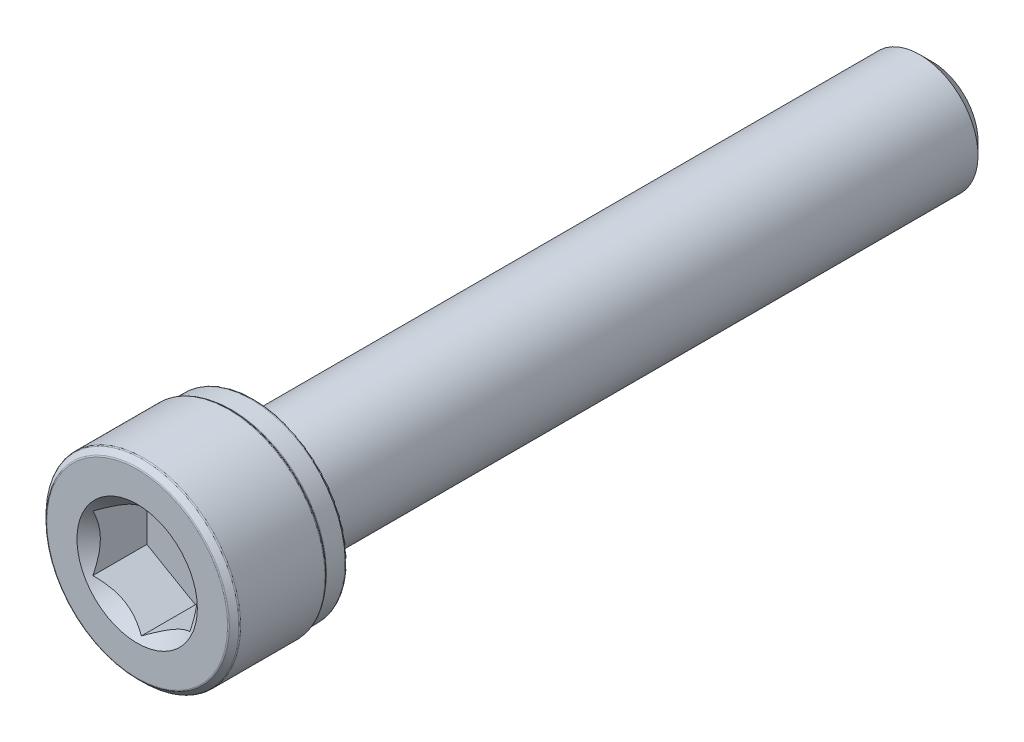
ISO-10303-21;
HEADER;
FILE_DESCRIPTION(('STEP AP214'),'2;1');
FILE_NAME('part.step','',(''),(''),'','','');
FILE_SCHEMA(('AUTOMOTIVE_DESIGN { 1 0 10303 214 1 1 1 1 }'));
ENDSEC;
DATA;
#1=APPLICATION_CONTEXT('core data for automotive mechanical design processes');
#2=APPLICATION_PROTOCOL_DEFINITION('international standard','automotive_design',2000,#1);
#3=PRODUCT_CONTEXT('',#1,'mechanical');
#4=PRODUCT('Part','Part','',(#3));
#5=PRODUCT_RELATED_PRODUCT_CATEGORY('part','',(#4));
#6=PRODUCT_DEFINITION_FORMATION('','',#4);
#7=PRODUCT_DEFINITION_CONTEXT('part definition',#1,'design');
#8=PRODUCT_DEFINITION('design','',#6,#7);
#9=PRODUCT_DEFINITION_SHAPE('','',#8);
#10=(LENGTH_UNIT() NAMED_UNIT(*) SI_UNIT(.MILLI.,.METRE.));
#11=(NAMED_UNIT(*) PLANE_ANGLE_UNIT() SI_UNIT($,.RADIAN.));
#12=(NAMED_UNIT(*) SI_UNIT($,.STERADIAN.) SOLID_ANGLE_UNIT());
#13=UNCERTAINTY_MEASURE_WITH_UNIT(LENGTH_MEASURE(1.E-05),#10,'distance_accuracy_value','');
#14=(GEOMETRIC_REPRESENTATION_CONTEXT(3) GLOBAL_UNCERTAINTY_ASSIGNED_CONTEXT((#13)) GLOBAL_UNIT_ASSIGNED_CONTEXT((#10,
#11,#12)) REPRESENTATION_CONTEXT('',''));
#15=CARTESIAN_POINT('',(0.,0.,0.));
#16=DIRECTION('',(0.,0.,1.));
#17=DIRECTION('',(1.,0.,0.));
#18=AXIS2_PLACEMENT_3D('',#15,#16,#17);
#19=CARTESIAN_POINT('',(0.,2.35048094716167,-20.5));
#20=DIRECTION('',(0.,0.,-1.));
#21=DIRECTION('',(0.,1.,0.));
#22=AXIS2_PLACEMENT_3D('',#19,#20,#21);
#23=PLANE('',#22);
#24=CARTESIAN_POINT('',(0.,0.,-20.5));
#25=DIRECTION('',(0.,0.,-1.));
#26=DIRECTION('',(0.,1.,0.));
#27=AXIS2_PLACEMENT_3D('',#24,#25,#26);
#28=CIRCLE('',#27,2.35048094716167);
#29=CARTESIAN_POINT('',(0.,2.35048094716167,-20.5));
#30=VERTEX_POINT('',#29);
#31=EDGE_CURVE('E12',#30,#30,#28,.T.);
#32=ORIENTED_EDGE('',*,*,#31,.T.);
#33=EDGE_LOOP('',(#32));
#34=FACE_BOUND('',#33,.T.);
#35=ADVANCED_FACE('F38',(#34),#23,.T.);
#36=CARTESIAN_POINT('',(0.,0.,-20.5));
#37=DIRECTION('',(0.,0.,1.));
#38=DIRECTION('',(0.,-1.,0.));
#39=AXIS2_PLACEMENT_3D('',#36,#37,#38);
#40=CONICAL_SURFACE('',#39,2.35048094716167,0.785398163397439);
#41=CARTESIAN_POINT('',(0.,0.,-19.8504809471617));
#42=DIRECTION('',(0.,0.,-1.));
#43=DIRECTION('',(0.,1.,0.));
#44=AXIS2_PLACEMENT_3D('',#41,#42,#43);
#45=CIRCLE('',#44,3.);
#46=CARTESIAN_POINT('',(0.,3.,-19.8504809471617));
#47=VERTEX_POINT('',#46);
#48=EDGE_CURVE('E45',#47,#47,#45,.T.);
#49=ORIENTED_EDGE('',*,*,#48,.T.);
#50=EDGE_LOOP('',(#49));
#51=FACE_BOUND('',#50,.T.);
#52=ORIENTED_EDGE('',*,*,#31,.F.);
#53=EDGE_LOOP('',(#52));
#54=FACE_BOUND('',#53,.T.);
#55=ADVANCED_FACE('F157',(#51,#54),#40,.T.);
#56=CARTESIAN_POINT('',(0.,0.,-20.5));
#57=DIRECTION('',(0.,0.,-1.));
#58=DIRECTION('',(0.,1.,0.));
#59=AXIS2_PLACEMENT_3D('',#56,#57,#58);
#60=CYLINDRICAL_SURFACE('',#59,3.);
#61=CARTESIAN_POINT('',(0.,0.,14.2));
#62=DIRECTION('',(0.,0.,-1.));
#63=DIRECTION('',(0.,1.,0.));
#64=AXIS2_PLACEMENT_3D('',#61,#62,#63);
#65=CIRCLE('',#64,3.);
#66=CARTESIAN_POINT('',(0.,3.,14.2));
#67=VERTEX_POINT('',#66);
#68=EDGE_CURVE('E152',#67,#67,#65,.T.);
#69=ORIENTED_EDGE('',*,*,#68,.T.);
#70=EDGE_LOOP('',(#69));
#71=FACE_BOUND('',#70,.T.);
#72=ORIENTED_EDGE('',*,*,#48,.F.);
#73=EDGE_LOOP('',(#72));
#74=FACE_BOUND('',#73,.T.);
#75=ADVANCED_FACE('F160',(#71,#74),#60,.T.);
#76=CARTESIAN_POINT('',(0.,0.,14.2));
#77=DIRECTION('',(0.,0.,-1.));
#78=DIRECTION('',(0.,1.,0.));
#79=AXIS2_PLACEMENT_3D('',#76,#77,#78);
#80=TOROIDAL_SURFACE('',#79,3.3,0.300000000000001);
#81=CARTESIAN_POINT('',(0.,0.,14.5));
#82=DIRECTION('',(0.,0.,-1.));
#83=DIRECTION('',(0.,1.,0.));
#84=AXIS2_PLACEMENT_3D('',#81,#82,#83);
#85=CIRCLE('',#84,3.3);
#86=CARTESIAN_POINT('',(0.,3.3,14.5));
#87=VERTEX_POINT('',#86);
#88=EDGE_CURVE('E149',#87,#87,#85,.T.);
#89=ORIENTED_EDGE('',*,*,#88,.T.);
#90=EDGE_LOOP('',(#89));
#91=FACE_BOUND('',#90,.T.);
#92=ORIENTED_EDGE('',*,*,#68,.F.);
#93=EDGE_LOOP('',(#92));
#94=FACE_BOUND('',#93,.T.);
#95=ADVANCED_FACE('F162',(#91,#94),#80,.F.);
#96=CARTESIAN_POINT('',(0.,4.725,14.5));
#97=DIRECTION('',(0.,0.,-1.));
#98=DIRECTION('',(0.,1.,0.));
#99=AXIS2_PLACEMENT_3D('',#96,#97,#98);
#100=PLANE('',#99);
#101=CARTESIAN_POINT('',(0.,0.,14.5));
#102=DIRECTION('',(0.,0.,-1.));
#103=DIRECTION('',(0.,1.,0.));
#104=AXIS2_PLACEMENT_3D('',#101,#102,#103);
#105=CIRCLE('',#104,4.725);
#106=CARTESIAN_POINT('',(0.,4.725,14.5));
#107=VERTEX_POINT('',#106);
#108=EDGE_CURVE('E146',#107,#107,#105,.T.);
#109=ORIENTED_EDGE('',*,*,#108,.T.);
#110=EDGE_LOOP('',(#109));
#111=FACE_BOUND('',#110,.T.);
#112=ORIENTED_EDGE('',*,*,#88,.F.);
#113=EDGE_LOOP('',(#112));
#114=FACE_BOUND('',#113,.T.);
#115=ADVANCED_FACE('F169',(#111,#114),#100,.T.);
#116=CARTESIAN_POINT('',(0.,0.,14.625));
#117=DIRECTION('',(0.,0.,-1.));
#118=DIRECTION('',(0.,1.,0.));
#119=AXIS2_PLACEMENT_3D('',#116,#117,#118);
#120=TOROIDAL_SURFACE('',#119,4.725,0.125);
#121=CARTESIAN_POINT('',(0.,0.,14.625));
#122=DIRECTION('',(0.,0.,-1.));
#123=DIRECTION('',(0.,1.,0.));
#124=AXIS2_PLACEMENT_3D('',#121,#122,#123);
#125=CIRCLE('',#124,4.85);
#126=CARTESIAN_POINT('',(0.,4.85,14.625));
#127=VERTEX_POINT('',#126);
#128=EDGE_CURVE('E143',#127,#127,#125,.T.);
#129=ORIENTED_EDGE('',*,*,#128,.T.);
#130=EDGE_LOOP('',(#129));
#131=FACE_BOUND('',#130,.T.);
#132=ORIENTED_EDGE('',*,*,#108,.F.);
#133=EDGE_LOOP('',(#132));
#134=FACE_BOUND('',#133,.T.);
#135=ADVANCED_FACE('F200',(#131,#134),#120,.T.);
#136=CARTESIAN_POINT('',(0.,0.,-20.5));
#137=DIRECTION('',(0.,0.,-1.));
#138=DIRECTION('',(0.,1.,0.));
#139=AXIS2_PLACEMENT_3D('',#136,#137,#138);
#140=CYLINDRICAL_SURFACE('',#139,4.85);
#141=CARTESIAN_POINT('',(0.,0.,15.5861674785275));
#142=DIRECTION('',(0.,0.,-1.));
#143=DIRECTION('',(0.,1.,0.));
#144=AXIS2_PLACEMENT_3D('',#141,#142,#143);
#145=CIRCLE('',#144,4.85);
#146=CARTESIAN_POINT('',(0.,4.85,15.5861674785275));
#147=VERTEX_POINT('',#146);
#148=EDGE_CURVE('E140',#147,#147,#145,.T.);
#149=ORIENTED_EDGE('',*,*,#148,.T.);
#150=EDGE_LOOP('',(#149));
#151=FACE_BOUND('',#150,.T.);
#152=ORIENTED_EDGE('',*,*,#128,.F.);
#153=EDGE_LOOP('',(#152));
#154=FACE_BOUND('',#153,.T.);
#155=ADVANCED_FACE('F210',(#151,#154),#140,.T.);
#156=CARTESIAN_POINT('',(0.,0.,15.5861674785275));
#157=DIRECTION('',(0.,0.,-1.));
#158=DIRECTION('',(0.,1.,0.));
#159=AXIS2_PLACEMENT_3D('',#156,#157,#158);
#160=TOROIDAL_SURFACE('',#159,4.94375,0.0937499999999986);
#161=CARTESIAN_POINT('',(0.,0.,15.6524587392638));
#162=DIRECTION('',(0.,0.,-1.));
#163=DIRECTION('',(0.,1.,0.));
#164=AXIS2_PLACEMENT_3D('',#161,#162,#163);
#165=CIRCLE('',#164,4.87745873926377);
#166=CARTESIAN_POINT('',(0.,4.87745873926377,15.6524587392638));
#167=VERTEX_POINT('',#166);
#168=EDGE_CURVE('E137',#167,#167,#165,.T.);
#169=ORIENTED_EDGE('',*,*,#168,.T.);
#170=EDGE_LOOP('',(#169));
#171=FACE_BOUND('',#170,.T.);
#172=ORIENTED_EDGE('',*,*,#148,.F.);
#173=EDGE_LOOP('',(#172));
#174=FACE_BOUND('',#173,.T.);
#175=ADVANCED_FACE('F220',(#171,#174),#160,.F.);
#176=CARTESIAN_POINT('',(0.,0.,15.6524587392638));
#177=DIRECTION('',(0.,0.,1.));
#178=DIRECTION('',(0.,-1.,0.));
#179=AXIS2_PLACEMENT_3D('',#176,#177,#178);
#180=CONICAL_SURFACE('',#179,4.87745873926377,0.785398163397448);
#181=CARTESIAN_POINT('',(0.,0.,15.7475412607362));
#182=DIRECTION('',(0.,0.,-1.));
#183=DIRECTION('',(0.,1.,0.));
#184=AXIS2_PLACEMENT_3D('',#181,#182,#183);
#185=CIRCLE('',#184,4.97254126073624);
#186=CARTESIAN_POINT('',(0.,4.97254126073624,15.7475412607362));
#187=VERTEX_POINT('',#186);
#188=EDGE_CURVE('E134',#187,#187,#185,.T.);
#189=ORIENTED_EDGE('',*,*,#188,.T.);
#190=EDGE_LOOP('',(#189));
#191=FACE_BOUND('',#190,.T.);
#192=ORIENTED_EDGE('',*,*,#168,.F.);
#193=EDGE_LOOP('',(#192));
#194=FACE_BOUND('',#193,.T.);
#195=ADVANCED_FACE('F230',(#191,#194),#180,.T.);
#196=CARTESIAN_POINT('',(0.,0.,15.8138325214725));
#197=DIRECTION('',(0.,0.,-1.));
#198=DIRECTION('',(0.,1.,0.));
#199=AXIS2_PLACEMENT_3D('',#196,#197,#198);
#200=TOROIDAL_SURFACE('',#199,4.90625,0.0937500000000017);
#201=CARTESIAN_POINT('',(0.,0.,15.8138325214725));
#202=DIRECTION('',(0.,0.,-1.));
#203=DIRECTION('',(0.,1.,0.));
#204=AXIS2_PLACEMENT_3D('',#201,#202,#203);
#205=CIRCLE('',#204,5.);
#206=CARTESIAN_POINT('',(0.,5.,15.8138325214725));
#207=VERTEX_POINT('',#206);
#208=EDGE_CURVE('E131',#207,#207,#205,.T.);
#209=ORIENTED_EDGE('',*,*,#208,.T.);
#210=EDGE_LOOP('',(#209));
#211=FACE_BOUND('',#210,.T.);
#212=ORIENTED_EDGE('',*,*,#188,.F.);
#213=EDGE_LOOP('',(#212));
#214=FACE_BOUND('',#213,.T.);
#215=ADVANCED_FACE('F240',(#211,#214),#200,.T.);
#216=CARTESIAN_POINT('',(0.,0.,-20.5));
#217=DIRECTION('',(0.,0.,-1.));
#218=DIRECTION('',(0.,1.,0.));
#219=AXIS2_PLACEMENT_3D('',#216,#217,#218);
#220=CYLINDRICAL_SURFACE('',#219,5.);
#221=CARTESIAN_POINT('',(0.,0.,20.1611674785275));
#222=DIRECTION('',(0.,0.,-1.));
#223=DIRECTION('',(0.,1.,0.));
#224=AXIS2_PLACEMENT_3D('',#221,#222,#223);
#225=CIRCLE('',#224,5.);
#226=CARTESIAN_POINT('',(0.,5.,20.1611674785275));
#227=VERTEX_POINT('',#226);
#228=EDGE_CURVE('E128',#227,#227,#225,.T.);
#229=ORIENTED_EDGE('',*,*,#228,.T.);
#230=EDGE_LOOP('',(#229));
#231=FACE_BOUND('',#230,.T.);
#232=ORIENTED_EDGE('',*,*,#208,.F.);
#233=EDGE_LOOP('',(#232));
#234=FACE_BOUND('',#233,.T.);
#235=ADVANCED_FACE('F250',(#231,#234),#220,.T.);
#236=CARTESIAN_POINT('',(0.,0.,20.1611674785275));
#237=DIRECTION('',(0.,0.,-1.));
#238=DIRECTION('',(0.,1.,0.));
#239=AXIS2_PLACEMENT_3D('',#236,#237,#238);
#240=TOROIDAL_SURFACE('',#239,4.90625,0.093749999999998);
#241=CARTESIAN_POINT('',(0.,0.,20.2274587392638));
#242=DIRECTION('',(0.,0.,-1.));
#243=DIRECTION('',(0.,1.,0.));
#244=AXIS2_PLACEMENT_3D('',#241,#242,#243);
#245=CIRCLE('',#244,4.97254126073624);
#246=CARTESIAN_POINT('',(0.,4.97254126073624,20.2274587392638));
#247=VERTEX_POINT('',#246);
#248=EDGE_CURVE('E125',#247,#247,#245,.T.);
#249=ORIENTED_EDGE('',*,*,#248,.T.);
#250=EDGE_LOOP('',(#249));
#251=FACE_BOUND('',#250,.T.);
#252=ORIENTED_EDGE('',*,*,#228,.F.);
#253=EDGE_LOOP('',(#252));
#254=FACE_BOUND('',#253,.T.);
#255=ADVANCED_FACE('F260',(#251,#254),#240,.T.);
#256=CARTESIAN_POINT('',(0.,0.,20.2274587392638));
#257=DIRECTION('',(0.,0.,-1.));
#258=DIRECTION('',(0.,1.,0.));
#259=AXIS2_PLACEMENT_3D('',#256,#257,#258);
#260=CONICAL_SURFACE('',#259,4.97254126073624,0.785398163397445);
#261=CARTESIAN_POINT('',(0.,0.,20.4725412607362));
#262=DIRECTION('',(0.,0.,-1.));
#263=DIRECTION('',(0.,1.,0.));
#264=AXIS2_PLACEMENT_3D('',#261,#262,#263);
#265=CIRCLE('',#264,4.72745873926376);
#266=CARTESIAN_POINT('',(0.,4.72745873926376,20.4725412607362));
#267=VERTEX_POINT('',#266);
#268=EDGE_CURVE('E122',#267,#267,#265,.T.);
#269=ORIENTED_EDGE('',*,*,#268,.T.);
#270=EDGE_LOOP('',(#269));
#271=FACE_BOUND('',#270,.T.);
#272=ORIENTED_EDGE('',*,*,#248,.F.);
#273=EDGE_LOOP('',(#272));
#274=FACE_BOUND('',#273,.T.);
#275=ADVANCED_FACE('F270',(#271,#274),#260,.T.);
#276=CARTESIAN_POINT('',(0.,0.,20.40625));
#277=DIRECTION('',(0.,0.,-1.));
#278=DIRECTION('',(0.,1.,0.));
#279=AXIS2_PLACEMENT_3D('',#276,#277,#278);
#280=TOROIDAL_SURFACE('',#279,4.66116747852752,0.0937500000000004);
#281=CARTESIAN_POINT('',(0.,0.,20.5));
#282=DIRECTION('',(0.,0.,-1.));
#283=DIRECTION('',(0.,1.,0.));
#284=AXIS2_PLACEMENT_3D('',#281,#282,#283);
#285=CIRCLE('',#284,4.66116747852752);
#286=CARTESIAN_POINT('',(0.,4.66116747852752,20.5));
#287=VERTEX_POINT('',#286);
#288=EDGE_CURVE('E119',#287,#287,#285,.T.);
#289=ORIENTED_EDGE('',*,*,#288,.T.);
#290=EDGE_LOOP('',(#289));
#291=FACE_BOUND('',#290,.T.);
#292=ORIENTED_EDGE('',*,*,#268,.F.);
#293=EDGE_LOOP('',(#292));
#294=FACE_BOUND('',#293,.T.);
#295=ADVANCED_FACE('F280',(#291,#294),#280,.T.);
#296=CARTESIAN_POINT('',(0.,0.,20.5));
#297=DIRECTION('',(0.,0.,1.));
#298=DIRECTION('',(0.,-1.,0.));
#299=AXIS2_PLACEMENT_3D('',#296,#297,#298);
#300=PLANE('',#299);
#301=CARTESIAN_POINT('',(0.,0.,20.5));
#302=DIRECTION('',(0.,0.,1.));
#303=DIRECTION('',(1.,0.,0.));
#304=AXIS2_PLACEMENT_3D('',#301,#302,#303);
#305=CIRCLE('',#304,3.10325769689423);
#306=CARTESIAN_POINT('',(3.10325769689423,0.,20.5));
#307=VERTEX_POINT('',#306);
#308=EDGE_CURVE('E96',#307,#307,#305,.T.);
#309=ORIENTED_EDGE('',*,*,#308,.F.);
#310=EDGE_LOOP('',(#309));
#311=FACE_BOUND('',#310,.T.);
#312=ORIENTED_EDGE('',*,*,#288,.F.);
#313=EDGE_LOOP('',(#312));
#314=FACE_BOUND('',#313,.T.);
#315=ADVANCED_FACE('F290',(#311,#314),#300,.T.);
#316=CARTESIAN_POINT('',(0.,0.,20.5));
#317=DIRECTION('',(0.,0.,1.));
#318=DIRECTION('',(1.,0.,0.));
#319=AXIS2_PLACEMENT_3D('',#316,#317,#318);
#320=CONICAL_SURFACE('',#319,3.10325769689423,0.78539816339745);
#321=ORIENTED_EDGE('',*,*,#308,.T.);
#322=EDGE_LOOP('',(#321));
#323=FACE_BOUND('',#322,.T.);
#324=CARTESIAN_POINT('',(-2.50019999999999,-1.44326020292022,20.2836091260357));
#325=CARTESIAN_POINT('',(-2.41426172221223,-1.49287669073468,20.2340343544086));
#326=CARTESIAN_POINT('',(-2.32688643272424,-1.54332283764109,20.1873711304164));
#327=CARTESIAN_POINT('',(-2.14871854383441,-1.64618811625259,20.1019317890922));
#328=CARTESIAN_POINT('',(-2.05790899931892,-1.69861703122359,20.0632032114599));
#329=CARTESIAN_POINT('',(-1.87479587687308,-1.80433744175985,19.9968603529516));
#330=CARTESIAN_POINT('',(-1.78253893547066,-1.85760201171315,19.9690793175848));
#331=CARTESIAN_POINT('',(-1.59599399122371,-1.96530378549009,19.9262768249646));
#332=CARTESIAN_POINT('',(-1.50171168743371,-2.01973769896306,19.9112234157252));
#333=CARTESIAN_POINT('',(-1.33922174170815,-2.11355131286832,19.8976413712634));
#334=CARTESIAN_POINT('',(-1.27122403211985,-2.15280980880341,19.8956307482947));
#335=CARTESIAN_POINT('',(-1.13533975883078,-2.23126263056549,19.8990177662414));
#336=CARTESIAN_POINT('',(-1.06745324244776,-2.27045692907357,19.9044180043537));
#337=CARTESIAN_POINT('',(-0.932321211763892,-2.34847544336504,19.9223194374564));
#338=CARTESIAN_POINT('',(-0.865076500246437,-2.38729919566122,19.9348285761004));
#339=CARTESIAN_POINT('',(-0.731749899181799,-2.46427534467603,19.9662611510096));
#340=CARTESIAN_POINT('',(-0.665667920900341,-2.50242779262541,19.9851840955507));
#341=CARTESIAN_POINT('',(-0.496403653308734,-2.60015256308361,20.0413610104621));
#342=CARTESIAN_POINT('',(-0.394270877777105,-2.65911894852988,20.0828494806501));
#343=CARTESIAN_POINT('',(-0.244093585059489,-2.74582384890656,20.152887695777));
#344=CARTESIAN_POINT('',(-0.194603460117388,-2.77439698586411,20.17749590117));
#345=CARTESIAN_POINT('',(-0.09653993616115,-2.83101398781793,20.2289555357691));
#346=CARTESIAN_POINT('',(-0.0479659965030684,-2.85905816495513,20.2558055878332));
#347=CARTESIAN_POINT('',(0.000200000000003583,-2.88686681600196,20.2836091260357));
#348=B_SPLINE_CURVE_WITH_KNOTS('',3,(#324,#325,#326,#327,#328,#329,#330,#331,#332,#333,#334,
#335,#336,#337,#338,#339,#340,#341,#342,#343,#344,#345,#346,#347),.UNSPECIFIED.,.F.,.F.,(4,2,2,
2,2,2,2,2,2,2,2,4),(0.,0.333012085133923,0.667964518301395,0.997597032043295,1.32639954393844,
1.56169424147168,1.79707142102082,2.0327121352217,2.2683347877565,2.64260240809533,
2.82922877818863,3.01574133749024),.UNSPECIFIED.);
#349=CARTESIAN_POINT('',(-2.49999999999999,-1.44337567297406,20.2834936490539));
#350=VERTEX_POINT('',#349);
#351=CARTESIAN_POINT('',(0.,-2.88675134594812,20.2834936490539));
#352=VERTEX_POINT('',#351);
#353=EDGE_CURVE('E103',#350,#352,#348,.T.);
#354=ORIENTED_EDGE('',*,*,#353,.F.);
#355=CARTESIAN_POINT('',(-2.49999999999999,-3.04044292478689,21.3330214063817));
#356=CARTESIAN_POINT('',(-2.49999999999999,-2.96709478172556,21.2763788487171));
#357=CARTESIAN_POINT('',(-2.49999999999999,-2.89335465135761,21.2202359693275));
#358=CARTESIAN_POINT('',(-2.49999999999999,-2.74492905640711,21.1091787819783));
#359=CARTESIAN_POINT('',(-2.49999999999999,-2.67024337493574,21.0542647641906));
#360=CARTESIAN_POINT('',(-2.49999999999999,-2.51921990828823,20.9455038420407));
#361=CARTESIAN_POINT('',(-2.49999999999999,-2.44287382770905,20.891668419147));
#362=CARTESIAN_POINT('',(-2.49999999999999,-2.28891665120371,20.7858441602624));
#363=CARTESIAN_POINT('',(-2.49999999999999,-2.21130564250584,20.7338551977208));
#364=CARTESIAN_POINT('',(-2.49999999999999,-2.04951799142744,20.6288457042913));
#365=CARTESIAN_POINT('',(-2.49999999999999,-1.96524215656548,20.5759772332794));
#366=CARTESIAN_POINT('',(-2.49999999999999,-1.79473490703968,20.4734987026906));
#367=CARTESIAN_POINT('',(-2.49999999999999,-1.70850374831487,20.4238882199388));
#368=CARTESIAN_POINT('',(-2.49999999999999,-1.53401833929874,20.3289545270337));
#369=CARTESIAN_POINT('',(-2.49999999999999,-1.44577065756376,20.2836193384592));
#370=CARTESIAN_POINT('',(-2.49999999999999,-1.26676310994808,20.1982604224777));
#371=CARTESIAN_POINT('',(-2.49999999999999,-1.17600446376454,20.158234169168));
#372=CARTESIAN_POINT('',(-2.49999999999999,-1.00118351570531,20.0886962875671));
#373=CARTESIAN_POINT('',(-2.49999999999999,-0.917385051629535,20.0585280842829));
#374=CARTESIAN_POINT('',(-2.49999999999999,-0.74762906009993,20.0048969377877));
#375=CARTESIAN_POINT('',(-2.49999999999999,-0.661671397551603,19.9814344152734));
#376=CARTESIAN_POINT('',(-2.49999999999999,-0.489622081200866,19.9428857605003));
#377=CARTESIAN_POINT('',(-2.49999999999999,-0.403565521298247,19.9276456482725));
#378=CARTESIAN_POINT('',(-2.49999999999999,-0.230352389629815,19.9058639492467));
#379=CARTESIAN_POINT('',(-2.49999999999999,-0.143196059113858,19.8993204870893));
#380=CARTESIAN_POINT('',(-2.49999999999999,0.0273612295446655,19.895504167584));
#381=CARTESIAN_POINT('',(-2.49999999999999,0.1107531319748,19.8978241071313));
#382=CARTESIAN_POINT('',(-2.49999999999999,0.276898134935756,19.9106653349727));
#383=CARTESIAN_POINT('',(-2.49999999999999,0.359651177707744,19.921187356241));
#384=CARTESIAN_POINT('',(-2.49999999999999,0.525325927795181,19.9500114990314));
#385=CARTESIAN_POINT('',(-2.49999999999999,0.608223175291063,19.9684520406654));
#386=CARTESIAN_POINT('',(-2.49999999999999,0.772178834557463,20.0120846864152));
#387=CARTESIAN_POINT('',(-2.5,0.853237339741923,20.0372764467107));
#388=CARTESIAN_POINT('',(-2.5,1.10159689599554,20.1241193926927));
#389=CARTESIAN_POINT('',(-2.5,1.2655525401235,20.1953668377805));
#390=CARTESIAN_POINT('',(-2.5,1.50551769780195,20.3142345481021));
#391=CARTESIAN_POINT('',(-2.5,1.58465788064154,20.3559484521643));
#392=CARTESIAN_POINT('',(-2.5,1.74114816885993,20.4426161601922));
#393=CARTESIAN_POINT('',(-2.5,1.81849858456147,20.4875693968529));
#394=CARTESIAN_POINT('',(-2.5,1.96784059769267,20.5777853522682));
#395=CARTESIAN_POINT('',(-2.5,2.03990833441822,20.6229234485208));
#396=CARTESIAN_POINT('',(-2.5,2.18280709640722,20.7151257428437));
#397=CARTESIAN_POINT('',(-2.5,2.2536380285734,20.7621900850232));
#398=CARTESIAN_POINT('',(-2.5,2.39365462675841,20.8575181428367));
#399=CARTESIAN_POINT('',(-2.5,2.46284892785042,20.905769227967));
#400=CARTESIAN_POINT('',(-2.5,2.60028772768959,21.0035675953205));
#401=CARTESIAN_POINT('',(-2.5,2.66853248306037,21.0531145164816));
#402=CARTESIAN_POINT('',(-2.5,2.73637900498552,21.1031920948776));
#403=B_SPLINE_CURVE_WITH_KNOTS('',3,(#355,#356,#357,#358,#359,#360,#361,#362,#363,#364,#365,
#366,#367,#368,#369,#370,#371,#372,#373,#374,#375,#376,#377,#378,#379,#380,#381,#382,#383,#384,
#385,#386,#387,#388,#389,#390,#391,#392,#393,#394,#395,#396,#397,#398,#399,#400,#401,#402),
.UNSPECIFIED.,.F.,.F.,(4,2,2,2,2,2,2,2,2,2,2,2,2,2,2,2,2,2,2,2,2,2,2,4),(0.,0.278024739230087,
0.556114450273835,0.83634673753147,1.11655978131475,1.41496015304213,1.71332168905072,
2.01082076966665,2.30817779353376,2.57513879386763,2.84211653895114,3.10390388797606,
3.36563477559627,3.61548897009283,3.8653654952273,4.11980016461985,4.37422187884308,
4.90887010890444,5.17722912654035,5.44554126009377,5.70061957252691,5.95571700326382,
6.20877059828286,6.46175442014511),.UNSPECIFIED.);
#404=CARTESIAN_POINT('',(-2.5,1.44337567297406,20.2834936490539));
#405=VERTEX_POINT('',#404);
#406=EDGE_CURVE('E414',#405,#350,#403,.F.);
#407=ORIENTED_EDGE('',*,*,#406,.F.);
#408=CARTESIAN_POINT('',(0.000200000000000959,2.88686681600196,20.2836091260357));
#409=CARTESIAN_POINT('',(-0.0857382777877635,2.8372503281875,20.2340343544086));
#410=CARTESIAN_POINT('',(-0.173113567275752,2.78680418128109,20.1873711304164));
#411=CARTESIAN_POINT('',(-0.351281456165587,2.6839389026696,20.1019317890922));
#412=CARTESIAN_POINT('',(-0.442091000681073,2.63150998769859,20.0632032114599));
#413=CARTESIAN_POINT('',(-0.625204123126919,2.52578957716233,19.9968603529516));
#414=CARTESIAN_POINT('',(-0.717461064529339,2.47252500720903,19.9690793175848));
#415=CARTESIAN_POINT('',(-0.904006008776284,2.3648232334321,19.9262768249646));
#416=CARTESIAN_POINT('',(-0.998288312566281,2.31038931995912,19.9112234157252));
#417=CARTESIAN_POINT('',(-1.16077825829184,2.21657570605386,19.8976413712634));
#418=CARTESIAN_POINT('',(-1.22877596788015,2.17731721011878,19.8956307482947));
#419=CARTESIAN_POINT('',(-1.36466024116922,2.0988643883567,19.8990177662414));
#420=CARTESIAN_POINT('',(-1.43254675755223,2.05967008984862,19.9044180043537));
#421=CARTESIAN_POINT('',(-1.5676787882361,1.98165157555714,19.9223194374564));
#422=CARTESIAN_POINT('',(-1.63492349975356,1.94282782326096,19.9348285761004));
#423=CARTESIAN_POINT('',(-1.76825010081819,1.86585167424616,19.9662611510096));
#424=CARTESIAN_POINT('',(-1.83433207909965,1.82769922629677,19.9851840955507));
#425=CARTESIAN_POINT('',(-2.00359634669126,1.72997445583857,20.0413610104621));
#426=CARTESIAN_POINT('',(-2.10572912222289,1.6710080703923,20.0828494806501));
#427=CARTESIAN_POINT('',(-2.2559064149405,1.58430317001562,20.152887695777));
#428=CARTESIAN_POINT('',(-2.3053965398826,1.55573003305807,20.17749590117));
#429=CARTESIAN_POINT('',(-2.40346006383884,1.49911303110425,20.2289555357691));
#430=CARTESIAN_POINT('',(-2.45203400349692,1.47106885396706,20.2558055878333));
#431=CARTESIAN_POINT('',(-2.5002,1.44326020292022,20.2836091260357));
#432=B_SPLINE_CURVE_WITH_KNOTS('',3,(#408,#409,#410,#411,#412,#413,#414,#415,#416,#417,#418,
#419,#420,#421,#422,#423,#424,#425,#426,#427,#428,#429,#430,#431),.UNSPECIFIED.,.F.,.F.,(4,2,2,
2,2,2,2,2,2,2,2,4),(0.,0.333012085133924,0.667964518301397,0.9975970320433,1.32639954393844,
1.56169424147168,1.79707142102083,2.0327121352217,2.2683347877565,2.64260240809533,
2.82922877818863,3.01574133749024),.UNSPECIFIED.);
#433=CARTESIAN_POINT('',(0.,2.88675134594812,20.2834936490539));
#434=VERTEX_POINT('',#433);
#435=EDGE_CURVE('E409',#434,#405,#432,.T.);
#436=ORIENTED_EDGE('',*,*,#435,.F.);
#437=CARTESIAN_POINT('',(2.5002,1.44326020292022,20.2836091260357));
#438=CARTESIAN_POINT('',(2.41426172221223,1.49287669073468,20.2340343544086));
#439=CARTESIAN_POINT('',(2.32688643272425,1.54332283764109,20.1873711304164));
#440=CARTESIAN_POINT('',(2.14871854383441,1.64618811625259,20.1019317890922));
#441=CARTESIAN_POINT('',(2.05790899931892,1.69861703122359,20.0632032114599));
#442=CARTESIAN_POINT('',(1.87479587687308,1.80433744175985,19.9968603529516));
#443=CARTESIAN_POINT('',(1.78253893547066,1.85760201171315,19.9690793175848));
#444=CARTESIAN_POINT('',(1.59599399122371,1.96530378549009,19.9262768249646));
#445=CARTESIAN_POINT('',(1.50171168743372,2.01973769896306,19.9112234157252));
#446=CARTESIAN_POINT('',(1.33922174170815,2.11355131286832,19.8976413712634));
#447=CARTESIAN_POINT('',(1.27122403211985,2.15280980880341,19.8956307482947));
#448=CARTESIAN_POINT('',(1.13533975883078,2.23126263056549,19.8990177662414));
#449=CARTESIAN_POINT('',(1.06745324244776,2.27045692907357,19.9044180043537));
#450=CARTESIAN_POINT('',(0.932321211763893,2.34847544336504,19.9223194374564));
#451=CARTESIAN_POINT('',(0.865076500246439,2.38729919566122,19.9348285761004));
#452=CARTESIAN_POINT('',(0.731749899181801,2.46427534467603,19.9662611510096));
#453=CARTESIAN_POINT('',(0.665667920900342,2.50242779262541,19.9851840955507));
#454=CARTESIAN_POINT('',(0.496403653308735,2.60015256308361,20.0413610104621));
#455=CARTESIAN_POINT('',(0.394270877777107,2.65911894852988,20.0828494806501));
#456=CARTESIAN_POINT('',(0.244093585059491,2.74582384890657,20.152887695777));
#457=CARTESIAN_POINT('',(0.194603460117391,2.77439698586412,20.17749590117));
#458=CARTESIAN_POINT('',(0.0965399361611536,2.83101398781793,20.2289555357691));
#459=CARTESIAN_POINT('',(0.0479659965030723,2.85905816495513,20.2558055878333));
#460=CARTESIAN_POINT('',(-0.000199999999999767,2.88686681600196,20.2836091260357));
#461=B_SPLINE_CURVE_WITH_KNOTS('',3,(#437,#438,#439,#440,#441,#442,#443,#444,#445,#446,#447,
#448,#449,#450,#451,#452,#453,#454,#455,#456,#457,#458,#459,#460),.UNSPECIFIED.,.F.,.F.,(4,2,2,
2,2,2,2,2,2,2,2,4),(0.,0.333012085133923,0.667964518301396,0.997597032043298,1.32639954393844,
1.56169424147169,1.79707142102083,2.03271213522171,2.26833478775651,2.64260240809533,
2.82922877818864,3.01574133749025),.UNSPECIFIED.);
#462=CARTESIAN_POINT('',(2.5,1.44337567297406,20.2834936490539));
#463=VERTEX_POINT('',#462);
#464=EDGE_CURVE('E52',#463,#434,#461,.T.);
#465=ORIENTED_EDGE('',*,*,#464,.F.);
#466=CARTESIAN_POINT('',(2.5,-3.04044292478688,21.3330214063817));
#467=CARTESIAN_POINT('',(2.5,-2.96709478172555,21.2763788487171));
#468=CARTESIAN_POINT('',(2.5,-2.89335465135761,21.2202359693275));
#469=CARTESIAN_POINT('',(2.5,-2.74492905640711,21.1091787819783));
#470=CARTESIAN_POINT('',(2.5,-2.67024337493573,21.0542647641906));
#471=CARTESIAN_POINT('',(2.5,-2.51921990828823,20.9455038420407));
#472=CARTESIAN_POINT('',(2.5,-2.44287382770904,20.891668419147));
#473=CARTESIAN_POINT('',(2.5,-2.28891665120371,20.7858441602624));
#474=CARTESIAN_POINT('',(2.5,-2.21130564250583,20.7338551977208));
#475=CARTESIAN_POINT('',(2.5,-2.04951799142743,20.6288457042913));
#476=CARTESIAN_POINT('',(2.5,-1.96524215656548,20.5759772332794));
#477=CARTESIAN_POINT('',(2.5,-1.79473490703968,20.4734987026906));
#478=CARTESIAN_POINT('',(2.5,-1.70850374831487,20.4238882199388));
#479=CARTESIAN_POINT('',(2.5,-1.53401833929874,20.3289545270337));
#480=CARTESIAN_POINT('',(2.5,-1.44577065756375,20.2836193384592));
#481=CARTESIAN_POINT('',(2.5,-1.26676310994808,20.1982604224777));
#482=CARTESIAN_POINT('',(2.5,-1.17600446376453,20.158234169168));
#483=CARTESIAN_POINT('',(2.5,-1.00118351570531,20.0886962875671));
#484=CARTESIAN_POINT('',(2.5,-0.91738505162953,20.0585280842829));
#485=CARTESIAN_POINT('',(2.5,-0.747629060099926,20.0048969377877));
#486=CARTESIAN_POINT('',(2.5,-0.6616713975516,19.9814344152734));
#487=CARTESIAN_POINT('',(2.5,-0.489622081200864,19.9428857605003));
#488=CARTESIAN_POINT('',(2.5,-0.403565521298246,19.9276456482725));
#489=CARTESIAN_POINT('',(2.5,-0.230352389629815,19.9058639492467));
#490=CARTESIAN_POINT('',(2.5,-0.143196059113858,19.8993204870893));
#491=CARTESIAN_POINT('',(2.5,0.0273612295446649,19.895504167584));
#492=CARTESIAN_POINT('',(2.5,0.110753131974799,19.8978241071313));
#493=CARTESIAN_POINT('',(2.5,0.276898134935755,19.9106653349727));
#494=CARTESIAN_POINT('',(2.5,0.359651177707743,19.921187356241));
#495=CARTESIAN_POINT('',(2.5,0.525325927795181,19.9500114990314));
#496=CARTESIAN_POINT('',(2.5,0.608223175291063,19.9684520406654));
#497=CARTESIAN_POINT('',(2.5,0.772178834557464,20.0120846864152));
#498=CARTESIAN_POINT('',(2.5,0.853237339741924,20.0372764467107));
#499=CARTESIAN_POINT('',(2.5,1.10159689599555,20.1241193926927));
#500=CARTESIAN_POINT('',(2.5,1.2655525401235,20.1953668377805));
#501=CARTESIAN_POINT('',(2.5,1.50551769780196,20.3142345481021));
#502=CARTESIAN_POINT('',(2.5,1.58465788064155,20.3559484521643));
#503=CARTESIAN_POINT('',(2.5,1.74114816885994,20.4426161601922));
#504=CARTESIAN_POINT('',(2.5,1.81849858456148,20.4875693968529));
#505=CARTESIAN_POINT('',(2.5,1.96784059769267,20.5777853522682));
#506=CARTESIAN_POINT('',(2.5,2.03990833441822,20.6229234485208));
#507=CARTESIAN_POINT('',(2.5,2.18280709640722,20.7151257428437));
#508=CARTESIAN_POINT('',(2.5,2.2536380285734,20.7621900850232));
#509=CARTESIAN_POINT('',(2.5,2.39365462675841,20.8575181428367));
#510=CARTESIAN_POINT('',(2.5,2.46284892785043,20.905769227967));
#511=CARTESIAN_POINT('',(2.5,2.60028772768959,21.0035675953205));
#512=CARTESIAN_POINT('',(2.5,2.66853248306037,21.0531145164816));
#513=CARTESIAN_POINT('',(2.5,2.73637900498552,21.1031920948776));
#514=B_SPLINE_CURVE_WITH_KNOTS('',3,(#466,#467,#468,#469,#470,#471,#472,#473,#474,#475,#476,
#477,#478,#479,#480,#481,#482,#483,#484,#485,#486,#487,#488,#489,#490,#491,#492,#493,#494,#495,
#496,#497,#498,#499,#500,#501,#502,#503,#504,#505,#506,#507,#508,#509,#510,#511,#512,#513),
.UNSPECIFIED.,.F.,.F.,(4,2,2,2,2,2,2,2,2,2,2,2,2,2,2,2,2,2,2,2,2,2,2,4),(0.,0.278024739230084,
0.556114450273832,0.83634673753147,1.11655978131475,1.41496015304213,1.71332168905071,
2.01082076966664,2.30817779353376,2.57513879386763,2.84211653895114,3.10390388797605,
3.36563477559627,3.61548897009282,3.86536549522729,4.11980016461984,4.37422187884307,
4.90887010890444,5.17722912654035,5.44554126009377,5.70061957252691,5.95571700326381,
6.20877059828285,6.4617544201451),.UNSPECIFIED.);
#515=CARTESIAN_POINT('',(2.5,-1.44337567297406,20.2834936490539));
#516=VERTEX_POINT('',#515);
#517=EDGE_CURVE('E89',#516,#463,#514,.T.);
#518=ORIENTED_EDGE('',*,*,#517,.F.);
#519=CARTESIAN_POINT('',(-0.000199999999996549,-2.88686681600196,20.2836091260357));
#520=CARTESIAN_POINT('',(0.0857382777877677,-2.8372503281875,20.2340343544086));
#521=CARTESIAN_POINT('',(0.173113567275755,-2.78680418128109,20.1873711304164));
#522=CARTESIAN_POINT('',(0.35128145616559,-2.6839389026696,20.1019317890922));
#523=CARTESIAN_POINT('',(0.442091000681076,-2.63150998769859,20.0632032114599));
#524=CARTESIAN_POINT('',(0.625204123126921,-2.52578957716233,19.9968603529516));
#525=CARTESIAN_POINT('',(0.71746106452934,-2.47252500720903,19.9690793175848));
#526=CARTESIAN_POINT('',(0.904006008776284,-2.3648232334321,19.9262768249646));
#527=CARTESIAN_POINT('',(0.998288312566281,-2.31038931995912,19.9112234157252));
#528=CARTESIAN_POINT('',(1.16077825829184,-2.21657570605386,19.8976413712634));
#529=CARTESIAN_POINT('',(1.22877596788015,-2.17731721011878,19.8956307482947));
#530=CARTESIAN_POINT('',(1.36466024116922,-2.0988643883567,19.8990177662414));
#531=CARTESIAN_POINT('',(1.43254675755223,-2.05967008984862,19.9044180043537));
#532=CARTESIAN_POINT('',(1.5676787882361,-1.98165157555714,19.9223194374564));
#533=CARTESIAN_POINT('',(1.63492349975356,-1.94282782326096,19.9348285761004));
#534=CARTESIAN_POINT('',(1.76825010081819,-1.86585167424616,19.9662611510096));
#535=CARTESIAN_POINT('',(1.83433207909965,-1.82769922629677,19.9851840955507));
#536=CARTESIAN_POINT('',(2.00359634669126,-1.72997445583857,20.0413610104621));
#537=CARTESIAN_POINT('',(2.10572912222289,-1.6710080703923,20.0828494806501));
#538=CARTESIAN_POINT('',(2.25590641494051,-1.58430317001562,20.152887695777));
#539=CARTESIAN_POINT('',(2.30539653988261,-1.55573003305807,20.17749590117));
#540=CARTESIAN_POINT('',(2.40346006383885,-1.49911303110425,20.2289555357691));
#541=CARTESIAN_POINT('',(2.45203400349693,-1.47106885396706,20.2558055878333));
#542=CARTESIAN_POINT('',(2.5002,-1.44326020292022,20.2836091260357));
#543=B_SPLINE_CURVE_WITH_KNOTS('',3,(#519,#520,#521,#522,#523,#524,#525,#526,#527,#528,#529,
#530,#531,#532,#533,#534,#535,#536,#537,#538,#539,#540,#541,#542),.UNSPECIFIED.,.F.,.F.,(4,2,2,
2,2,2,2,2,2,2,2,4),(0.,0.333012085133921,0.667964518301393,0.997597032043293,1.32639954393843,
1.56169424147168,1.79707142102082,2.0327121352217,2.2683347877565,2.64260240809532,
2.82922877818863,3.01574133749024),.UNSPECIFIED.);
#544=EDGE_CURVE('E92',#352,#516,#543,.T.);
#545=ORIENTED_EDGE('',*,*,#544,.F.);
#546=EDGE_LOOP('',(#354,#407,#436,#465,#518,#545));
#547=FACE_BOUND('',#546,.T.);
#548=ADVANCED_FACE('F91',(#323,#547),#320,.F.);
#549=CARTESIAN_POINT('',(0.,0.,17.5));
#550=DIRECTION('',(0.,0.,1.));
#551=DIRECTION('',(1.,0.,0.));
#552=AXIS2_PLACEMENT_3D('',#549,#550,#551);
#553=PLANE('',#552);
#554=DIRECTION('',(0.866025403784438,0.5,0.));
#555=VECTOR('',#554,1.);
#556=CARTESIAN_POINT('',(0.,-2.88675134594812,17.5));
#557=LINE('',#556,#555);
#558=CARTESIAN_POINT('',(0.,-2.88675134594812,17.5));
#559=VERTEX_POINT('',#558);
#560=CARTESIAN_POINT('',(2.5,-1.44337567297406,17.5));
#561=VERTEX_POINT('',#560);
#562=EDGE_CURVE('E102',#559,#561,#557,.T.);
#563=ORIENTED_EDGE('',*,*,#562,.T.);
#564=DIRECTION('',(0.,1.,0.));
#565=VECTOR('',#564,1.);
#566=CARTESIAN_POINT('',(2.5,-1.44337567297406,17.5));
#567=LINE('',#566,#565);
#568=CARTESIAN_POINT('',(2.5,1.44337567297406,17.5));
#569=VERTEX_POINT('',#568);
#570=EDGE_CURVE('E107',#561,#569,#567,.T.);
#571=ORIENTED_EDGE('',*,*,#570,.T.);
#572=DIRECTION('',(-0.866025403784439,0.5,0.));
#573=VECTOR('',#572,1.);
#574=CARTESIAN_POINT('',(2.5,1.44337567297406,17.5));
#575=LINE('',#574,#573);
#576=CARTESIAN_POINT('',(0.,2.88675134594812,17.5));
#577=VERTEX_POINT('',#576);
#578=EDGE_CURVE('E442',#569,#577,#575,.T.);
#579=ORIENTED_EDGE('',*,*,#578,.T.);
#580=DIRECTION('',(-0.866025403784439,-0.5,0.));
#581=VECTOR('',#580,1.);
#582=CARTESIAN_POINT('',(0.,2.88675134594812,17.5));
#583=LINE('',#582,#581);
#584=CARTESIAN_POINT('',(-2.5,1.44337567297406,17.5));
#585=VERTEX_POINT('',#584);
#586=EDGE_CURVE('E431',#577,#585,#583,.T.);
#587=ORIENTED_EDGE('',*,*,#586,.T.);
#588=DIRECTION('',(0.,-1.,0.));
#589=VECTOR('',#588,1.);
#590=CARTESIAN_POINT('',(-2.5,1.44337567297406,17.5));
#591=LINE('',#590,#589);
#592=CARTESIAN_POINT('',(-2.49999999999999,-1.44337567297406,17.5));
#593=VERTEX_POINT('',#592);
#594=EDGE_CURVE('E115',#585,#593,#591,.T.);
#595=ORIENTED_EDGE('',*,*,#594,.T.);
#596=DIRECTION('',(0.866025403784439,-0.5,0.));
#597=VECTOR('',#596,1.);
#598=CARTESIAN_POINT('',(-2.49999999999999,-1.44337567297406,17.5));
#599=LINE('',#598,#597);
#600=EDGE_CURVE('E110',#593,#559,#599,.T.);
#601=ORIENTED_EDGE('',*,*,#600,.T.);
#602=EDGE_LOOP('',(#563,#571,#579,#587,#595,#601));
#603=FACE_BOUND('',#602,.T.);
#604=ADVANCED_FACE('F310',(#603),#553,.T.);
#605=CARTESIAN_POINT('',(2.5,-1.44337567297406,17.5));
#606=DIRECTION('',(1.,0.,0.));
#607=DIRECTION('',(0.,0.,-1.));
#608=AXIS2_PLACEMENT_3D('',#605,#606,#607);
#609=PLANE('',#608);
#610=DIRECTION('',(0.,0.,1.));
#611=VECTOR('',#610,1.);
#612=CARTESIAN_POINT('',(2.5,-1.44337567297406,17.5));
#613=LINE('',#612,#611);
#614=EDGE_CURVE('E100',#561,#516,#613,.T.);
#615=ORIENTED_EDGE('',*,*,#614,.T.);
#616=ORIENTED_EDGE('',*,*,#517,.T.);
#617=DIRECTION('',(0.,0.,1.));
#618=VECTOR('',#617,1.);
#619=CARTESIAN_POINT('',(2.5,1.44337567297406,17.5));
#620=LINE('',#619,#618);
#621=EDGE_CURVE('E109',#569,#463,#620,.T.);
#622=ORIENTED_EDGE('',*,*,#621,.F.);
#623=ORIENTED_EDGE('',*,*,#570,.F.);
#624=EDGE_LOOP('',(#615,#616,#622,#623));
#625=FACE_BOUND('',#624,.T.);
#626=ADVANCED_FACE('F105',(#625),#609,.F.);
#627=CARTESIAN_POINT('',(2.5,1.44337567297406,17.5));
#628=DIRECTION('',(0.5,0.866025403784439,0.));
#629=DIRECTION('',(-0.866025403784439,0.5,0.));
#630=AXIS2_PLACEMENT_3D('',#627,#628,#629);
#631=PLANE('',#630);
#632=ORIENTED_EDGE('',*,*,#621,.T.);
#633=ORIENTED_EDGE('',*,*,#464,.T.);
#634=DIRECTION('',(0.,0.,1.));
#635=VECTOR('',#634,1.);
#636=CARTESIAN_POINT('',(0.,2.88675134594812,17.5));
#637=LINE('',#636,#635);
#638=EDGE_CURVE('E112',#577,#434,#637,.T.);
#639=ORIENTED_EDGE('',*,*,#638,.F.);
#640=ORIENTED_EDGE('',*,*,#578,.F.);
#641=EDGE_LOOP('',(#632,#633,#639,#640));
#642=FACE_BOUND('',#641,.T.);
#643=ADVANCED_FACE('F329',(#642),#631,.F.);
#644=CARTESIAN_POINT('',(0.,2.88675134594812,17.5));
#645=DIRECTION('',(-0.5,0.866025403784439,0.));
#646=DIRECTION('',(-0.866025403784439,-0.5,0.));
#647=AXIS2_PLACEMENT_3D('',#644,#645,#646);
#648=PLANE('',#647);
#649=ORIENTED_EDGE('',*,*,#638,.T.);
#650=ORIENTED_EDGE('',*,*,#435,.T.);
#651=DIRECTION('',(0.,0.,1.));
#652=VECTOR('',#651,1.);
#653=CARTESIAN_POINT('',(-2.5,1.44337567297406,17.5));
#654=LINE('',#653,#652);
#655=EDGE_CURVE('E433',#585,#405,#654,.T.);
#656=ORIENTED_EDGE('',*,*,#655,.F.);
#657=ORIENTED_EDGE('',*,*,#586,.F.);
#658=EDGE_LOOP('',(#649,#650,#656,#657));
#659=FACE_BOUND('',#658,.T.);
#660=ADVANCED_FACE('F338',(#659),#648,.F.);
#661=CARTESIAN_POINT('',(-2.5,1.44337567297406,17.5));
#662=DIRECTION('',(-1.,0.,0.));
#663=DIRECTION('',(0.,-1.,0.));
#664=AXIS2_PLACEMENT_3D('',#661,#662,#663);
#665=PLANE('',#664);
#666=ORIENTED_EDGE('',*,*,#655,.T.);
#667=ORIENTED_EDGE('',*,*,#406,.T.);
#668=DIRECTION('',(0.,0.,1.));
#669=VECTOR('',#668,1.);
#670=CARTESIAN_POINT('',(-2.49999999999999,-1.44337567297406,17.5));
#671=LINE('',#670,#669);
#672=EDGE_CURVE('E434',#593,#350,#671,.T.);
#673=ORIENTED_EDGE('',*,*,#672,.F.);
#674=ORIENTED_EDGE('',*,*,#594,.F.);
#675=EDGE_LOOP('',(#666,#667,#673,#674));
#676=FACE_BOUND('',#675,.T.);
#677=ADVANCED_FACE('F348',(#676),#665,.F.);
#678=CARTESIAN_POINT('',(-2.49999999999999,-1.44337567297406,17.5));
#679=DIRECTION('',(-0.5,-0.866025403784439,0.));
#680=DIRECTION('',(0.866025403784439,-0.5,0.));
#681=AXIS2_PLACEMENT_3D('',#678,#679,#680);
#682=PLANE('',#681);
#683=ORIENTED_EDGE('',*,*,#672,.T.);
#684=ORIENTED_EDGE('',*,*,#353,.T.);
#685=DIRECTION('',(0.,0.,1.));
#686=VECTOR('',#685,1.);
#687=CARTESIAN_POINT('',(0.,-2.88675134594812,17.5));
#688=LINE('',#687,#686);
#689=EDGE_CURVE('E60',#559,#352,#688,.T.);
#690=ORIENTED_EDGE('',*,*,#689,.F.);
#691=ORIENTED_EDGE('',*,*,#600,.F.);
#692=EDGE_LOOP('',(#683,#684,#690,#691));
#693=FACE_BOUND('',#692,.T.);
#694=ADVANCED_FACE('F358',(#693),#682,.F.);
#695=CARTESIAN_POINT('',(0.,-2.88675134594812,17.5));
#696=DIRECTION('',(0.5,-0.866025403784438,0.));
#697=DIRECTION('',(0.866025403784439,0.5,0.));
#698=AXIS2_PLACEMENT_3D('',#695,#696,#697);
#699=PLANE('',#698);
#700=ORIENTED_EDGE('',*,*,#689,.T.);
#701=ORIENTED_EDGE('',*,*,#544,.T.);
#702=ORIENTED_EDGE('',*,*,#614,.F.);
#703=ORIENTED_EDGE('',*,*,#562,.F.);
#704=EDGE_LOOP('',(#700,#701,#702,#703));
#705=FACE_BOUND('',#704,.T.);
#706=ADVANCED_FACE('F99',(#705),#699,.F.);
#707=CLOSED_SHELL('',(#35,#55,#75,#95,#115,#135,#155,#175,#195,#215,#235,#255,#275,#295,#315,
#548,#604,#626,#643,#660,#677,#694,#706));
#708=MANIFOLD_SOLID_BREP('B2',#707);
#709=ADVANCED_BREP_SHAPE_REPRESENTATION('',(#18,#708),#14);
#710=SHAPE_DEFINITION_REPRESENTATION(#9,#709);
ENDSEC;
END-ISO-10303-21;
